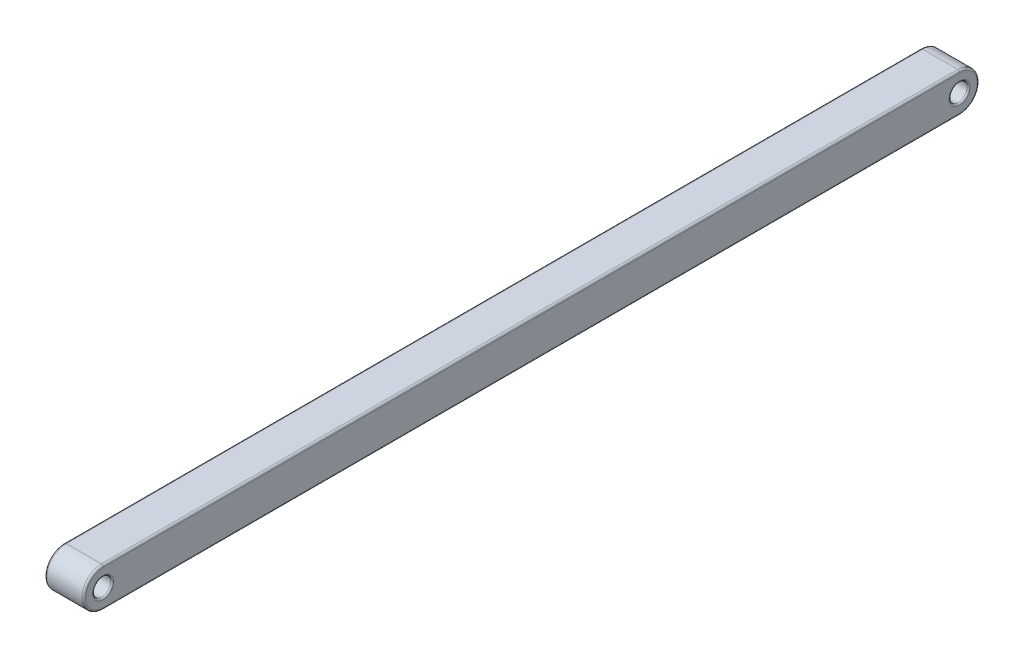
ISO-10303-21;
HEADER;
FILE_DESCRIPTION(('STEP AP214'),'2;1');
FILE_NAME('part.step','',(''),(''),'','','');
FILE_SCHEMA(('AUTOMOTIVE_DESIGN { 1 0 10303 214 1 1 1 1 }'));
ENDSEC;
DATA;
#1=APPLICATION_CONTEXT('core data for automotive mechanical design processes');
#2=APPLICATION_PROTOCOL_DEFINITION('international standard','automotive_design',2000,#1);
#3=PRODUCT_CONTEXT('',#1,'mechanical');
#4=PRODUCT('Part','Part','',(#3));
#5=PRODUCT_RELATED_PRODUCT_CATEGORY('part','',(#4));
#6=PRODUCT_DEFINITION_FORMATION('','',#4);
#7=PRODUCT_DEFINITION_CONTEXT('part definition',#1,'design');
#8=PRODUCT_DEFINITION('design','',#6,#7);
#9=PRODUCT_DEFINITION_SHAPE('','',#8);
#10=(LENGTH_UNIT() NAMED_UNIT(*) SI_UNIT(.MILLI.,.METRE.));
#11=(NAMED_UNIT(*) PLANE_ANGLE_UNIT() SI_UNIT($,.RADIAN.));
#12=(NAMED_UNIT(*) SI_UNIT($,.STERADIAN.) SOLID_ANGLE_UNIT());
#13=UNCERTAINTY_MEASURE_WITH_UNIT(LENGTH_MEASURE(1.E-05),#10,'distance_accuracy_value','');
#14=(GEOMETRIC_REPRESENTATION_CONTEXT(3) GLOBAL_UNCERTAINTY_ASSIGNED_CONTEXT((#13)) GLOBAL_UNIT_ASSIGNED_CONTEXT((#10,
#11,#12)) REPRESENTATION_CONTEXT('',''));
#15=CARTESIAN_POINT('',(0.,0.,0.));
#16=DIRECTION('',(0.,0.,1.));
#17=DIRECTION('',(1.,0.,0.));
#18=AXIS2_PLACEMENT_3D('',#15,#16,#17);
#19=CARTESIAN_POINT('',(2.5,-1.25,0.));
#20=DIRECTION('',(-1.,0.,0.));
#21=DIRECTION('',(0.,0.,1.));
#22=AXIS2_PLACEMENT_3D('',#19,#20,#21);
#23=PLANE('',#22);
#24=CARTESIAN_POINT('',(2.5,-1.25,0.));
#25=DIRECTION('',(-1.,0.,0.));
#26=DIRECTION('',(0.,0.,1.));
#27=AXIS2_PLACEMENT_3D('',#24,#25,#26);
#28=CIRCLE('',#27,0.675);
#29=CARTESIAN_POINT('',(2.5,-1.25,0.675));
#30=VERTEX_POINT('',#29);
#31=EDGE_CURVE('E187',#30,#30,#28,.T.);
#32=ORIENTED_EDGE('',*,*,#31,.T.);
#33=EDGE_LOOP('',(#32));
#34=FACE_BOUND('',#33,.T.);
#35=CARTESIAN_POINT('',(2.5,-1.25,-55.));
#36=DIRECTION('',(-1.,0.,0.));
#37=DIRECTION('',(0.,0.,1.));
#38=AXIS2_PLACEMENT_3D('',#35,#36,#37);
#39=CIRCLE('',#38,0.675000000000002);
#40=CARTESIAN_POINT('',(2.5,-1.25,-54.325));
#41=VERTEX_POINT('',#40);
#42=EDGE_CURVE('E183',#41,#41,#39,.T.);
#43=ORIENTED_EDGE('',*,*,#42,.T.);
#44=EDGE_LOOP('',(#43));
#45=FACE_BOUND('',#44,.T.);
#46=CARTESIAN_POINT('',(2.5,-1.25,0.));
#47=DIRECTION('',(-1.,0.,0.));
#48=DIRECTION('',(0.,0.,1.));
#49=AXIS2_PLACEMENT_3D('',#46,#47,#48);
#50=CIRCLE('',#49,1.125);
#51=CARTESIAN_POINT('',(2.5,-0.125,0.));
#52=VERTEX_POINT('',#51);
#53=CARTESIAN_POINT('',(2.5,-2.375,0.));
#54=VERTEX_POINT('',#53);
#55=EDGE_CURVE('E66',#52,#54,#50,.F.);
#56=ORIENTED_EDGE('',*,*,#55,.T.);
#57=DIRECTION('',(0.,0.,-1.));
#58=VECTOR('',#57,1.);
#59=CARTESIAN_POINT('',(2.5,-2.375,0.));
#60=LINE('',#59,#58);
#61=CARTESIAN_POINT('',(2.5,-2.37500000000001,-55.));
#62=VERTEX_POINT('',#61);
#63=EDGE_CURVE('E61',#54,#62,#60,.T.);
#64=ORIENTED_EDGE('',*,*,#63,.T.);
#65=CARTESIAN_POINT('',(2.5,-1.25,-55.));
#66=DIRECTION('',(-1.,0.,0.));
#67=DIRECTION('',(0.,0.,1.));
#68=AXIS2_PLACEMENT_3D('',#65,#66,#67);
#69=CIRCLE('',#68,1.12500000000002);
#70=CARTESIAN_POINT('',(2.5,-0.124999999999967,-55.));
#71=VERTEX_POINT('',#70);
#72=EDGE_CURVE('E311',#62,#71,#69,.F.);
#73=ORIENTED_EDGE('',*,*,#72,.T.);
#74=DIRECTION('',(0.,0.,1.));
#75=VECTOR('',#74,1.);
#76=CARTESIAN_POINT('',(2.5,-0.125,0.));
#77=LINE('',#76,#75);
#78=EDGE_CURVE('E150',#71,#52,#77,.T.);
#79=ORIENTED_EDGE('',*,*,#78,.T.);
#80=EDGE_LOOP('',(#56,#64,#73,#79));
#81=FACE_BOUND('',#80,.T.);
#82=ADVANCED_FACE('F45',(#34,#45,#81),#23,.F.);
#83=CARTESIAN_POINT('',(0.,-1.25,0.));
#84=DIRECTION('',(-1.,0.,0.));
#85=DIRECTION('',(0.,0.,1.));
#86=AXIS2_PLACEMENT_3D('',#83,#84,#85);
#87=PLANE('',#86);
#88=CARTESIAN_POINT('',(0.,-1.25,0.));
#89=DIRECTION('',(-1.,0.,0.));
#90=DIRECTION('',(0.,0.,1.));
#91=AXIS2_PLACEMENT_3D('',#88,#89,#90);
#92=CIRCLE('',#91,0.675);
#93=CARTESIAN_POINT('',(0.,-1.25,0.675));
#94=VERTEX_POINT('',#93);
#95=EDGE_CURVE('E171',#94,#94,#92,.F.);
#96=ORIENTED_EDGE('',*,*,#95,.T.);
#97=EDGE_LOOP('',(#96));
#98=FACE_BOUND('',#97,.T.);
#99=CARTESIAN_POINT('',(0.,-1.25,-55.));
#100=DIRECTION('',(-1.,0.,0.));
#101=DIRECTION('',(0.,0.,1.));
#102=AXIS2_PLACEMENT_3D('',#99,#100,#101);
#103=CIRCLE('',#102,0.675000000000002);
#104=CARTESIAN_POINT('',(0.,-1.25,-54.325));
#105=VERTEX_POINT('',#104);
#106=EDGE_CURVE('E167',#105,#105,#103,.F.);
#107=ORIENTED_EDGE('',*,*,#106,.T.);
#108=EDGE_LOOP('',(#107));
#109=FACE_BOUND('',#108,.T.);
#110=CARTESIAN_POINT('',(0.,-1.25,-55.));
#111=DIRECTION('',(-1.,0.,0.));
#112=DIRECTION('',(0.,0.,1.));
#113=AXIS2_PLACEMENT_3D('',#110,#111,#112);
#114=CIRCLE('',#113,1.12500000000002);
#115=CARTESIAN_POINT('',(0.,-0.124999999999967,-55.));
#116=VERTEX_POINT('',#115);
#117=CARTESIAN_POINT('',(0.,-2.37500000000001,-55.));
#118=VERTEX_POINT('',#117);
#119=EDGE_CURVE('E285',#116,#118,#114,.T.);
#120=ORIENTED_EDGE('',*,*,#119,.T.);
#121=DIRECTION('',(0.,0.,-1.));
#122=VECTOR('',#121,1.);
#123=CARTESIAN_POINT('',(0.,-2.375,0.));
#124=LINE('',#123,#122);
#125=CARTESIAN_POINT('',(0.,-2.375,0.));
#126=VERTEX_POINT('',#125);
#127=EDGE_CURVE('E287',#118,#126,#124,.F.);
#128=ORIENTED_EDGE('',*,*,#127,.T.);
#129=CARTESIAN_POINT('',(0.,-1.25,0.));
#130=DIRECTION('',(-1.,0.,0.));
#131=DIRECTION('',(0.,0.,1.));
#132=AXIS2_PLACEMENT_3D('',#129,#130,#131);
#133=CIRCLE('',#132,1.125);
#134=CARTESIAN_POINT('',(0.,-0.125,0.));
#135=VERTEX_POINT('',#134);
#136=EDGE_CURVE('E293',#126,#135,#133,.T.);
#137=ORIENTED_EDGE('',*,*,#136,.T.);
#138=DIRECTION('',(0.,0.,1.));
#139=VECTOR('',#138,1.);
#140=CARTESIAN_POINT('',(0.,-0.124999999999967,-55.));
#141=LINE('',#140,#139);
#142=EDGE_CURVE('E290',#135,#116,#141,.F.);
#143=ORIENTED_EDGE('',*,*,#142,.T.);
#144=EDGE_LOOP('',(#120,#128,#137,#143));
#145=FACE_BOUND('',#144,.T.);
#146=ADVANCED_FACE('F206',(#98,#109,#145),#87,.T.);
#147=CARTESIAN_POINT('',(2.5,-1.25,0.));
#148=DIRECTION('',(-1.,0.,0.));
#149=DIRECTION('',(0.,0.,1.));
#150=AXIS2_PLACEMENT_3D('',#147,#148,#149);
#151=CYLINDRICAL_SURFACE('',#150,1.25);
#152=DIRECTION('',(-1.,0.,0.));
#153=VECTOR('',#152,1.);
#154=CARTESIAN_POINT('',(2.5,0.,0.));
#155=LINE('',#154,#153);
#156=CARTESIAN_POINT('',(2.375,0.,0.));
#157=VERTEX_POINT('',#156);
#158=CARTESIAN_POINT('',(0.125,0.,0.));
#159=VERTEX_POINT('',#158);
#160=EDGE_CURVE('E117',#157,#159,#155,.T.);
#161=ORIENTED_EDGE('',*,*,#160,.T.);
#162=CARTESIAN_POINT('',(0.125,-1.25,0.));
#163=DIRECTION('',(-1.,0.,0.));
#164=DIRECTION('',(0.,0.,1.));
#165=AXIS2_PLACEMENT_3D('',#162,#163,#164);
#166=CIRCLE('',#165,1.25);
#167=CARTESIAN_POINT('',(0.125,-2.5,0.));
#168=VERTEX_POINT('',#167);
#169=EDGE_CURVE('E304',#159,#168,#166,.F.);
#170=ORIENTED_EDGE('',*,*,#169,.T.);
#171=DIRECTION('',(-1.,0.,0.));
#172=VECTOR('',#171,1.);
#173=CARTESIAN_POINT('',(2.5,-2.5,0.));
#174=LINE('',#173,#172);
#175=CARTESIAN_POINT('',(2.375,-2.5,0.));
#176=VERTEX_POINT('',#175);
#177=EDGE_CURVE('E147',#176,#168,#174,.T.);
#178=ORIENTED_EDGE('',*,*,#177,.F.);
#179=CARTESIAN_POINT('',(2.375,-1.25,0.));
#180=DIRECTION('',(-1.,0.,0.));
#181=DIRECTION('',(0.,0.,1.));
#182=AXIS2_PLACEMENT_3D('',#179,#180,#181);
#183=CIRCLE('',#182,1.25);
#184=EDGE_CURVE('E297',#176,#157,#183,.T.);
#185=ORIENTED_EDGE('',*,*,#184,.T.);
#186=EDGE_LOOP('',(#161,#170,#178,#185));
#187=FACE_BOUND('',#186,.T.);
#188=ADVANCED_FACE('F213',(#187),#151,.T.);
#189=CARTESIAN_POINT('',(2.5,-2.5,0.));
#190=DIRECTION('',(0.,1.,0.));
#191=DIRECTION('',(0.,0.,1.));
#192=AXIS2_PLACEMENT_3D('',#189,#190,#191);
#193=PLANE('',#192);
#194=DIRECTION('',(-1.,0.,0.));
#195=VECTOR('',#194,1.);
#196=CARTESIAN_POINT('',(2.5,-2.50000000000001,-55.));
#197=LINE('',#196,#195);
#198=CARTESIAN_POINT('',(2.375,-2.50000000000001,-55.));
#199=VERTEX_POINT('',#198);
#200=CARTESIAN_POINT('',(0.125,-2.50000000000001,-55.));
#201=VERTEX_POINT('',#200);
#202=EDGE_CURVE('E137',#199,#201,#197,.T.);
#203=ORIENTED_EDGE('',*,*,#202,.F.);
#204=DIRECTION('',(0.,0.,-1.));
#205=VECTOR('',#204,1.);
#206=CARTESIAN_POINT('',(2.375,-2.5,0.));
#207=LINE('',#206,#205);
#208=EDGE_CURVE('E124',#199,#176,#207,.F.);
#209=ORIENTED_EDGE('',*,*,#208,.T.);
#210=ORIENTED_EDGE('',*,*,#177,.T.);
#211=DIRECTION('',(0.,0.,-1.));
#212=VECTOR('',#211,1.);
#213=CARTESIAN_POINT('',(0.125,-2.5,-55.));
#214=LINE('',#213,#212);
#215=EDGE_CURVE('E316',#168,#201,#214,.T.);
#216=ORIENTED_EDGE('',*,*,#215,.T.);
#217=EDGE_LOOP('',(#203,#209,#210,#216));
#218=FACE_BOUND('',#217,.T.);
#219=ADVANCED_FACE('F225',(#218),#193,.F.);
#220=CARTESIAN_POINT('',(2.5,-1.25,-55.));
#221=DIRECTION('',(-1.,0.,0.));
#222=DIRECTION('',(0.,0.,1.));
#223=AXIS2_PLACEMENT_3D('',#220,#221,#222);
#224=CYLINDRICAL_SURFACE('',#223,1.25000000000002);
#225=ORIENTED_EDGE('',*,*,#202,.T.);
#226=CARTESIAN_POINT('',(0.125,-1.25,-55.));
#227=DIRECTION('',(-1.,0.,0.));
#228=DIRECTION('',(0.,0.,1.));
#229=AXIS2_PLACEMENT_3D('',#226,#227,#228);
#230=CIRCLE('',#229,1.25000000000002);
#231=CARTESIAN_POINT('',(0.125,0.,-55.));
#232=VERTEX_POINT('',#231);
#233=EDGE_CURVE('E135',#201,#232,#230,.F.);
#234=ORIENTED_EDGE('',*,*,#233,.T.);
#235=DIRECTION('',(-1.,0.,0.));
#236=VECTOR('',#235,1.);
#237=CARTESIAN_POINT('',(2.5,0.,-55.));
#238=LINE('',#237,#236);
#239=CARTESIAN_POINT('',(2.375,0.,-55.));
#240=VERTEX_POINT('',#239);
#241=EDGE_CURVE('E115',#240,#232,#238,.T.);
#242=ORIENTED_EDGE('',*,*,#241,.F.);
#243=CARTESIAN_POINT('',(2.375,-1.25,-55.));
#244=DIRECTION('',(-1.,0.,0.));
#245=DIRECTION('',(0.,0.,1.));
#246=AXIS2_PLACEMENT_3D('',#243,#244,#245);
#247=CIRCLE('',#246,1.25000000000002);
#248=EDGE_CURVE('E132',#240,#199,#247,.T.);
#249=ORIENTED_EDGE('',*,*,#248,.T.);
#250=EDGE_LOOP('',(#225,#234,#242,#249));
#251=FACE_BOUND('',#250,.T.);
#252=ADVANCED_FACE('F131',(#251),#224,.T.);
#253=CARTESIAN_POINT('',(2.5,0.,0.));
#254=DIRECTION('',(0.,-1.,0.));
#255=DIRECTION('',(0.,0.,-1.));
#256=AXIS2_PLACEMENT_3D('',#253,#254,#255);
#257=PLANE('',#256);
#258=ORIENTED_EDGE('',*,*,#241,.T.);
#259=DIRECTION('',(0.,0.,1.));
#260=VECTOR('',#259,1.);
#261=CARTESIAN_POINT('',(0.125,0.,0.));
#262=LINE('',#261,#260);
#263=EDGE_CURVE('E123',#232,#159,#262,.T.);
#264=ORIENTED_EDGE('',*,*,#263,.T.);
#265=ORIENTED_EDGE('',*,*,#160,.F.);
#266=DIRECTION('',(0.,0.,1.));
#267=VECTOR('',#266,1.);
#268=CARTESIAN_POINT('',(2.375,0.,0.));
#269=LINE('',#268,#267);
#270=EDGE_CURVE('E112',#157,#240,#269,.F.);
#271=ORIENTED_EDGE('',*,*,#270,.T.);
#272=EDGE_LOOP('',(#258,#264,#265,#271));
#273=FACE_BOUND('',#272,.T.);
#274=ADVANCED_FACE('F114',(#273),#257,.F.);
#275=CARTESIAN_POINT('',(2.5,-1.25,0.));
#276=DIRECTION('',(-1.,0.,0.));
#277=DIRECTION('',(0.,0.,1.));
#278=AXIS2_PLACEMENT_3D('',#275,#276,#277);
#279=CYLINDRICAL_SURFACE('',#278,0.575);
#280=CARTESIAN_POINT('',(0.0999999999999998,-1.25,0.));
#281=DIRECTION('',(-1.,0.,0.));
#282=DIRECTION('',(0.,0.,1.));
#283=AXIS2_PLACEMENT_3D('',#280,#281,#282);
#284=CIRCLE('',#283,0.575);
#285=CARTESIAN_POINT('',(0.0999999999999998,-1.25,0.575));
#286=VERTEX_POINT('',#285);
#287=EDGE_CURVE('E179',#286,#286,#284,.T.);
#288=ORIENTED_EDGE('',*,*,#287,.T.);
#289=EDGE_LOOP('',(#288));
#290=FACE_BOUND('',#289,.T.);
#291=CARTESIAN_POINT('',(2.4,-1.25,0.));
#292=DIRECTION('',(-1.,0.,0.));
#293=DIRECTION('',(0.,0.,1.));
#294=AXIS2_PLACEMENT_3D('',#291,#292,#293);
#295=CIRCLE('',#294,0.575);
#296=CARTESIAN_POINT('',(2.4,-1.25,0.575));
#297=VERTEX_POINT('',#296);
#298=EDGE_CURVE('E175',#297,#297,#295,.F.);
#299=ORIENTED_EDGE('',*,*,#298,.T.);
#300=EDGE_LOOP('',(#299));
#301=FACE_BOUND('',#300,.T.);
#302=ADVANCED_FACE('F218',(#290,#301),#279,.F.);
#303=CARTESIAN_POINT('',(2.5,-1.25,-55.));
#304=DIRECTION('',(-1.,0.,0.));
#305=DIRECTION('',(0.,0.,1.));
#306=AXIS2_PLACEMENT_3D('',#303,#304,#305);
#307=CYLINDRICAL_SURFACE('',#306,0.575000000000002);
#308=CARTESIAN_POINT('',(0.0999999999999998,-1.25,-55.));
#309=DIRECTION('',(-1.,0.,0.));
#310=DIRECTION('',(0.,0.,1.));
#311=AXIS2_PLACEMENT_3D('',#308,#309,#310);
#312=CIRCLE('',#311,0.575000000000002);
#313=CARTESIAN_POINT('',(0.0999999999999998,-1.25,-54.425));
#314=VERTEX_POINT('',#313);
#315=EDGE_CURVE('E11',#314,#314,#312,.T.);
#316=ORIENTED_EDGE('',*,*,#315,.T.);
#317=EDGE_LOOP('',(#316));
#318=FACE_BOUND('',#317,.T.);
#319=CARTESIAN_POINT('',(2.4,-1.25,-55.));
#320=DIRECTION('',(-1.,0.,0.));
#321=DIRECTION('',(0.,0.,1.));
#322=AXIS2_PLACEMENT_3D('',#319,#320,#321);
#323=CIRCLE('',#322,0.575000000000002);
#324=CARTESIAN_POINT('',(2.4,-1.25,-54.425));
#325=VERTEX_POINT('',#324);
#326=EDGE_CURVE('E54',#325,#325,#323,.F.);
#327=ORIENTED_EDGE('',*,*,#326,.T.);
#328=EDGE_LOOP('',(#327));
#329=FACE_BOUND('',#328,.T.);
#330=ADVANCED_FACE('F194',(#318,#329),#307,.F.);
#331=CARTESIAN_POINT('',(0.125,-1.25,0.));
#332=DIRECTION('',(-1.,0.,0.));
#333=DIRECTION('',(0.,0.,1.));
#334=AXIS2_PLACEMENT_3D('',#331,#332,#333);
#335=TOROIDAL_SURFACE('',#334,1.125,0.125);
#336=CARTESIAN_POINT('',(0.125,-0.125,0.));
#337=DIRECTION('',(0.,0.,-1.));
#338=DIRECTION('',(0.,1.,0.));
#339=AXIS2_PLACEMENT_3D('',#336,#337,#338);
#340=CIRCLE('',#339,0.125);
#341=EDGE_CURVE('E327',#135,#159,#340,.T.);
#342=ORIENTED_EDGE('',*,*,#341,.F.);
#343=ORIENTED_EDGE('',*,*,#136,.F.);
#344=CARTESIAN_POINT('',(0.125,-2.375,0.));
#345=DIRECTION('',(0.,0.,-1.));
#346=DIRECTION('',(0.,1.,0.));
#347=AXIS2_PLACEMENT_3D('',#344,#345,#346);
#348=CIRCLE('',#347,0.125);
#349=EDGE_CURVE('E157',#168,#126,#348,.T.);
#350=ORIENTED_EDGE('',*,*,#349,.F.);
#351=ORIENTED_EDGE('',*,*,#169,.F.);
#352=EDGE_LOOP('',(#342,#343,#350,#351));
#353=FACE_BOUND('',#352,.T.);
#354=ADVANCED_FACE('F244',(#353),#335,.T.);
#355=CARTESIAN_POINT('',(0.125,-2.375,0.));
#356=DIRECTION('',(0.,0.,1.));
#357=DIRECTION('',(1.,0.,0.));
#358=AXIS2_PLACEMENT_3D('',#355,#356,#357);
#359=CYLINDRICAL_SURFACE('',#358,0.125);
#360=ORIENTED_EDGE('',*,*,#349,.T.);
#361=ORIENTED_EDGE('',*,*,#127,.F.);
#362=CARTESIAN_POINT('',(0.125,-2.375,-55.));
#363=DIRECTION('',(0.,0.,-1.));
#364=DIRECTION('',(-1.,0.,0.));
#365=AXIS2_PLACEMENT_3D('',#362,#363,#364);
#366=CIRCLE('',#365,0.125);
#367=EDGE_CURVE('E325',#201,#118,#366,.T.);
#368=ORIENTED_EDGE('',*,*,#367,.F.);
#369=ORIENTED_EDGE('',*,*,#215,.F.);
#370=EDGE_LOOP('',(#360,#361,#368,#369));
#371=FACE_BOUND('',#370,.T.);
#372=ADVANCED_FACE('F240',(#371),#359,.T.);
#373=CARTESIAN_POINT('',(0.125,-0.125,0.));
#374=DIRECTION('',(0.,0.,-1.));
#375=DIRECTION('',(0.,1.,0.));
#376=AXIS2_PLACEMENT_3D('',#373,#374,#375);
#377=CYLINDRICAL_SURFACE('',#376,0.125);
#378=ORIENTED_EDGE('',*,*,#341,.T.);
#379=ORIENTED_EDGE('',*,*,#263,.F.);
#380=CARTESIAN_POINT('',(0.125,-0.124999999999967,-55.));
#381=DIRECTION('',(0.,0.,-1.));
#382=DIRECTION('',(-1.,0.,0.));
#383=AXIS2_PLACEMENT_3D('',#380,#381,#382);
#384=CIRCLE('',#383,0.125);
#385=EDGE_CURVE('E166',#116,#232,#384,.T.);
#386=ORIENTED_EDGE('',*,*,#385,.F.);
#387=ORIENTED_EDGE('',*,*,#142,.F.);
#388=EDGE_LOOP('',(#378,#379,#386,#387));
#389=FACE_BOUND('',#388,.T.);
#390=ADVANCED_FACE('F236',(#389),#377,.T.);
#391=CARTESIAN_POINT('',(0.125,-1.25,-55.));
#392=DIRECTION('',(-1.,0.,0.));
#393=DIRECTION('',(0.,0.,1.));
#394=AXIS2_PLACEMENT_3D('',#391,#392,#393);
#395=TOROIDAL_SURFACE('',#394,1.12500000000002,0.125);
#396=ORIENTED_EDGE('',*,*,#367,.T.);
#397=ORIENTED_EDGE('',*,*,#119,.F.);
#398=ORIENTED_EDGE('',*,*,#385,.T.);
#399=ORIENTED_EDGE('',*,*,#233,.F.);
#400=EDGE_LOOP('',(#396,#397,#398,#399));
#401=FACE_BOUND('',#400,.T.);
#402=ADVANCED_FACE('F232',(#401),#395,.T.);
#403=CARTESIAN_POINT('',(2.375,-1.25,0.));
#404=DIRECTION('',(-1.,0.,0.));
#405=DIRECTION('',(0.,0.,1.));
#406=AXIS2_PLACEMENT_3D('',#403,#404,#405);
#407=TOROIDAL_SURFACE('',#406,1.125,0.125);
#408=CARTESIAN_POINT('',(2.375,-0.125,0.));
#409=DIRECTION('',(0.,0.,-1.));
#410=DIRECTION('',(0.,1.,0.));
#411=AXIS2_PLACEMENT_3D('',#408,#409,#410);
#412=CIRCLE('',#411,0.125);
#413=EDGE_CURVE('E154',#157,#52,#412,.T.);
#414=ORIENTED_EDGE('',*,*,#413,.F.);
#415=ORIENTED_EDGE('',*,*,#184,.F.);
#416=CARTESIAN_POINT('',(2.375,-2.375,0.));
#417=DIRECTION('',(0.,0.,-1.));
#418=DIRECTION('',(0.,1.,0.));
#419=AXIS2_PLACEMENT_3D('',#416,#417,#418);
#420=CIRCLE('',#419,0.125);
#421=EDGE_CURVE('E162',#54,#176,#420,.T.);
#422=ORIENTED_EDGE('',*,*,#421,.F.);
#423=ORIENTED_EDGE('',*,*,#55,.F.);
#424=EDGE_LOOP('',(#414,#415,#422,#423));
#425=FACE_BOUND('',#424,.T.);
#426=ADVANCED_FACE('F235',(#425),#407,.T.);
#427=CARTESIAN_POINT('',(2.375,-2.375,0.));
#428=DIRECTION('',(0.,0.,-1.));
#429=DIRECTION('',(-1.,0.,0.));
#430=AXIS2_PLACEMENT_3D('',#427,#428,#429);
#431=CYLINDRICAL_SURFACE('',#430,0.125);
#432=ORIENTED_EDGE('',*,*,#421,.T.);
#433=ORIENTED_EDGE('',*,*,#208,.F.);
#434=CARTESIAN_POINT('',(2.375,-2.375,-55.));
#435=DIRECTION('',(0.,0.,-1.));
#436=DIRECTION('',(-1.,0.,0.));
#437=AXIS2_PLACEMENT_3D('',#434,#435,#436);
#438=CIRCLE('',#437,0.125);
#439=EDGE_CURVE('E144',#62,#199,#438,.T.);
#440=ORIENTED_EDGE('',*,*,#439,.F.);
#441=ORIENTED_EDGE('',*,*,#63,.F.);
#442=EDGE_LOOP('',(#432,#433,#440,#441));
#443=FACE_BOUND('',#442,.T.);
#444=ADVANCED_FACE('F253',(#443),#431,.T.);
#445=CARTESIAN_POINT('',(2.375,-0.125,0.));
#446=DIRECTION('',(0.,0.,1.));
#447=DIRECTION('',(0.,-1.,0.));
#448=AXIS2_PLACEMENT_3D('',#445,#446,#447);
#449=CYLINDRICAL_SURFACE('',#448,0.125);
#450=ORIENTED_EDGE('',*,*,#413,.T.);
#451=ORIENTED_EDGE('',*,*,#78,.F.);
#452=CARTESIAN_POINT('',(2.375,-0.124999999999967,-55.));
#453=DIRECTION('',(0.,0.,-1.));
#454=DIRECTION('',(-1.,0.,0.));
#455=AXIS2_PLACEMENT_3D('',#452,#453,#454);
#456=CIRCLE('',#455,0.125);
#457=EDGE_CURVE('E142',#240,#71,#456,.T.);
#458=ORIENTED_EDGE('',*,*,#457,.F.);
#459=ORIENTED_EDGE('',*,*,#270,.F.);
#460=EDGE_LOOP('',(#450,#451,#458,#459));
#461=FACE_BOUND('',#460,.T.);
#462=ADVANCED_FACE('F149',(#461),#449,.T.);
#463=CARTESIAN_POINT('',(2.375,-1.25,-55.));
#464=DIRECTION('',(-1.,0.,0.));
#465=DIRECTION('',(0.,0.,1.));
#466=AXIS2_PLACEMENT_3D('',#463,#464,#465);
#467=TOROIDAL_SURFACE('',#466,1.12500000000002,0.125);
#468=ORIENTED_EDGE('',*,*,#439,.T.);
#469=ORIENTED_EDGE('',*,*,#248,.F.);
#470=ORIENTED_EDGE('',*,*,#457,.T.);
#471=ORIENTED_EDGE('',*,*,#72,.F.);
#472=EDGE_LOOP('',(#468,#469,#470,#471));
#473=FACE_BOUND('',#472,.T.);
#474=ADVANCED_FACE('F140',(#473),#467,.T.);
#475=CARTESIAN_POINT('',(0.0999999999999998,-1.25,0.));
#476=DIRECTION('',(-1.,0.,0.));
#477=DIRECTION('',(0.,0.,1.));
#478=AXIS2_PLACEMENT_3D('',#475,#476,#477);
#479=TOROIDAL_SURFACE('',#478,0.675,0.1);
#480=ORIENTED_EDGE('',*,*,#287,.F.);
#481=EDGE_LOOP('',(#480));
#482=FACE_BOUND('',#481,.T.);
#483=ORIENTED_EDGE('',*,*,#95,.F.);
#484=EDGE_LOOP('',(#483));
#485=FACE_BOUND('',#484,.T.);
#486=ADVANCED_FACE('F250',(#482,#485),#479,.T.);
#487=CARTESIAN_POINT('',(2.4,-1.25,0.));
#488=DIRECTION('',(-1.,0.,0.));
#489=DIRECTION('',(0.,0.,1.));
#490=AXIS2_PLACEMENT_3D('',#487,#488,#489);
#491=TOROIDAL_SURFACE('',#490,0.675,0.1);
#492=ORIENTED_EDGE('',*,*,#31,.F.);
#493=EDGE_LOOP('',(#492));
#494=FACE_BOUND('',#493,.T.);
#495=ORIENTED_EDGE('',*,*,#298,.F.);
#496=EDGE_LOOP('',(#495));
#497=FACE_BOUND('',#496,.T.);
#498=ADVANCED_FACE('F202',(#494,#497),#491,.T.);
#499=CARTESIAN_POINT('',(0.0999999999999998,-1.25,-55.));
#500=DIRECTION('',(-1.,0.,0.));
#501=DIRECTION('',(0.,0.,1.));
#502=AXIS2_PLACEMENT_3D('',#499,#500,#501);
#503=TOROIDAL_SURFACE('',#502,0.675000000000002,0.1);
#504=ORIENTED_EDGE('',*,*,#315,.F.);
#505=EDGE_LOOP('',(#504));
#506=FACE_BOUND('',#505,.T.);
#507=ORIENTED_EDGE('',*,*,#106,.F.);
#508=EDGE_LOOP('',(#507));
#509=FACE_BOUND('',#508,.T.);
#510=ADVANCED_FACE('F197',(#506,#509),#503,.T.);
#511=CARTESIAN_POINT('',(2.4,-1.25,-55.));
#512=DIRECTION('',(-1.,0.,0.));
#513=DIRECTION('',(0.,0.,1.));
#514=AXIS2_PLACEMENT_3D('',#511,#512,#513);
#515=TOROIDAL_SURFACE('',#514,0.675000000000002,0.1);
#516=ORIENTED_EDGE('',*,*,#42,.F.);
#517=EDGE_LOOP('',(#516));
#518=FACE_BOUND('',#517,.T.);
#519=ORIENTED_EDGE('',*,*,#326,.F.);
#520=EDGE_LOOP('',(#519));
#521=FACE_BOUND('',#520,.T.);
#522=ADVANCED_FACE('F47',(#518,#521),#515,.T.);
#523=CLOSED_SHELL('',(#82,#146,#188,#219,#252,#274,#302,#330,#354,#372,#390,#402,#426,#444,#462,
#474,#486,#498,#510,#522));
#524=MANIFOLD_SOLID_BREP('B2',#523);
#525=ADVANCED_BREP_SHAPE_REPRESENTATION('',(#18,#524),#14);
#526=SHAPE_DEFINITION_REPRESENTATION(#9,#525);
ENDSEC;
END-ISO-10303-21;
